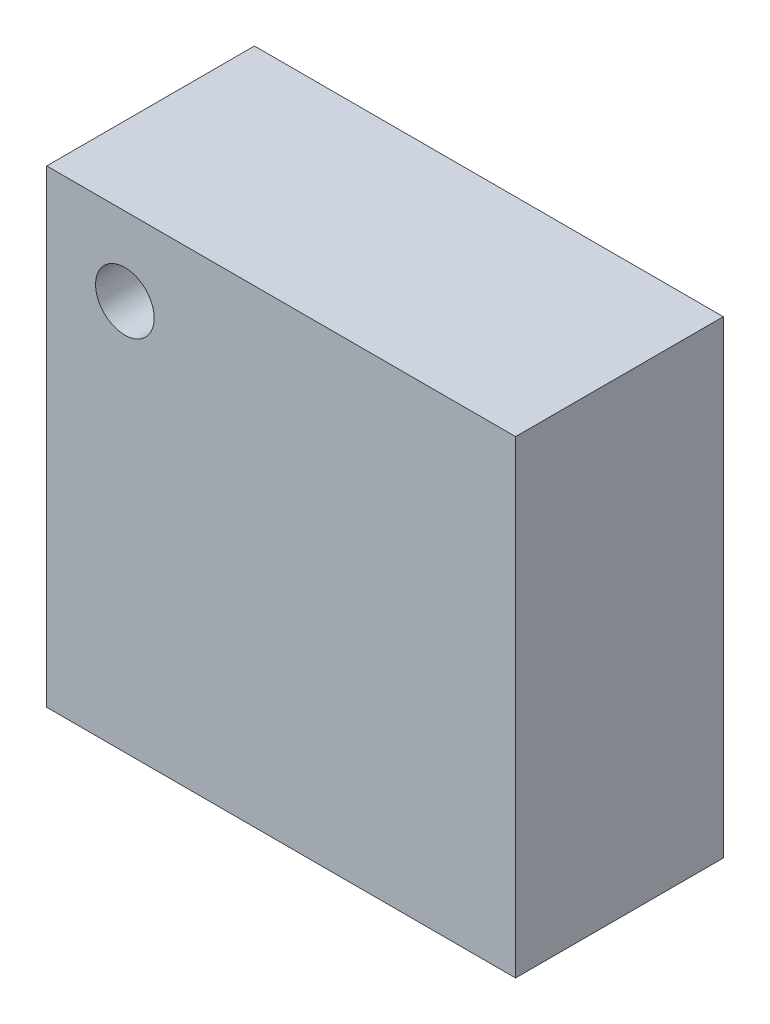
ISO-10303-21;
HEADER;
FILE_DESCRIPTION(('STEP AP214'),'2;1');
FILE_NAME('part.step','',(''),(''),'','','');
FILE_SCHEMA(('AUTOMOTIVE_DESIGN { 1 0 10303 214 1 1 1 1 }'));
ENDSEC;
DATA;
#1=APPLICATION_CONTEXT('core data for automotive mechanical design processes');
#2=APPLICATION_PROTOCOL_DEFINITION('international standard','automotive_design',2000,#1);
#3=PRODUCT_CONTEXT('',#1,'mechanical');
#4=PRODUCT('Part','Part','',(#3));
#5=PRODUCT_RELATED_PRODUCT_CATEGORY('part','',(#4));
#6=PRODUCT_DEFINITION_FORMATION('','',#4);
#7=PRODUCT_DEFINITION_CONTEXT('part definition',#1,'design');
#8=PRODUCT_DEFINITION('design','',#6,#7);
#9=PRODUCT_DEFINITION_SHAPE('','',#8);
#10=(LENGTH_UNIT() NAMED_UNIT(*) SI_UNIT(.MILLI.,.METRE.));
#11=(NAMED_UNIT(*) PLANE_ANGLE_UNIT() SI_UNIT($,.RADIAN.));
#12=(NAMED_UNIT(*) SI_UNIT($,.STERADIAN.) SOLID_ANGLE_UNIT());
#13=UNCERTAINTY_MEASURE_WITH_UNIT(LENGTH_MEASURE(1.E-05),#10,'distance_accuracy_value','');
#14=(GEOMETRIC_REPRESENTATION_CONTEXT(3) GLOBAL_UNCERTAINTY_ASSIGNED_CONTEXT((#13)) GLOBAL_UNIT_ASSIGNED_CONTEXT((#10,
#11,#12)) REPRESENTATION_CONTEXT('',''));
#15=CARTESIAN_POINT('',(0.,0.,0.));
#16=DIRECTION('',(0.,0.,1.));
#17=DIRECTION('',(1.,0.,0.));
#18=AXIS2_PLACEMENT_3D('',#15,#16,#17);
#19=CARTESIAN_POINT('',(0.131666666667,0.658333333333,0.45));
#20=DIRECTION('',(0.,0.,1.));
#21=DIRECTION('',(1.,0.,0.));
#22=AXIS2_PLACEMENT_3D('',#19,#20,#21);
#23=PLANE('',#22);
#24=CARTESIAN_POINT('',(0.131666666667,0.658333333333,0.45));
#25=DIRECTION('',(0.,0.,1.));
#26=DIRECTION('',(1.,0.,0.));
#27=AXIS2_PLACEMENT_3D('',#24,#25,#26);
#28=CIRCLE('',#27,0.049375);
#29=CARTESIAN_POINT('',(0.082291666667,0.658333333333,0.45));
#30=VERTEX_POINT('',#29);
#31=EDGE_CURVE('E26',#30,#30,#28,.T.);
#32=ORIENTED_EDGE('',*,*,#31,.T.);
#33=EDGE_LOOP('',(#32));
#34=FACE_BOUND('',#33,.T.);
#35=ADVANCED_FACE('F16',(#34),#23,.T.);
#36=CARTESIAN_POINT('',(0.131666666667,0.658333333333,0.45));
#37=DIRECTION('',(0.,0.,1.));
#38=DIRECTION('',(1.,0.,0.));
#39=AXIS2_PLACEMENT_3D('',#36,#37,#38);
#40=CYLINDRICAL_SURFACE('',#39,0.049375);
#41=ORIENTED_EDGE('',*,*,#31,.F.);
#42=DIRECTION('',(0.,0.,1.));
#43=VECTOR('',#42,1.);
#44=CARTESIAN_POINT('',(0.082291666667,0.658333333333,0.45));
#45=LINE('',#44,#43);
#46=CARTESIAN_POINT('',(0.082291666667,0.658333333333,0.55));
#47=VERTEX_POINT('',#46);
#48=EDGE_CURVE('E11',#30,#47,#45,.T.);
#49=ORIENTED_EDGE('',*,*,#48,.T.);
#50=CARTESIAN_POINT('',(0.131666666667,0.658333333333,0.55));
#51=DIRECTION('',(0.,0.,1.));
#52=DIRECTION('',(1.,0.,0.));
#53=AXIS2_PLACEMENT_3D('',#50,#51,#52);
#54=CIRCLE('',#53,0.049375);
#55=EDGE_CURVE('E128',#47,#47,#54,.T.);
#56=ORIENTED_EDGE('',*,*,#55,.T.);
#57=ORIENTED_EDGE('',*,*,#48,.F.);
#58=EDGE_LOOP('',(#41,#49,#56,#57));
#59=FACE_BOUND('',#58,.T.);
#60=ADVANCED_FACE('F147',(#59),#40,.F.);
#61=CARTESIAN_POINT('',(0.79,0.,0.2));
#62=DIRECTION('',(1.,0.,0.));
#63=DIRECTION('',(0.,1.,0.));
#64=AXIS2_PLACEMENT_3D('',#61,#62,#63);
#65=PLANE('',#64);
#66=DIRECTION('',(0.,0.,1.));
#67=VECTOR('',#66,1.);
#68=CARTESIAN_POINT('',(0.79,0.,0.2));
#69=LINE('',#68,#67);
#70=CARTESIAN_POINT('',(0.79,0.,0.2));
#71=VERTEX_POINT('',#70);
#72=CARTESIAN_POINT('',(0.79,0.,0.55));
#73=VERTEX_POINT('',#72);
#74=EDGE_CURVE('E67',#71,#73,#69,.T.);
#75=ORIENTED_EDGE('',*,*,#74,.F.);
#76=DIRECTION('',(0.,1.,0.));
#77=VECTOR('',#76,1.);
#78=CARTESIAN_POINT('',(0.79,0.,0.2));
#79=LINE('',#78,#77);
#80=CARTESIAN_POINT('',(0.79,0.79,0.2));
#81=VERTEX_POINT('',#80);
#82=EDGE_CURVE('E107',#71,#81,#79,.T.);
#83=ORIENTED_EDGE('',*,*,#82,.T.);
#84=DIRECTION('',(0.,0.,1.));
#85=VECTOR('',#84,1.);
#86=CARTESIAN_POINT('',(0.79,0.79,0.2));
#87=LINE('',#86,#85);
#88=CARTESIAN_POINT('',(0.79,0.79,0.55));
#89=VERTEX_POINT('',#88);
#90=EDGE_CURVE('E70',#81,#89,#87,.T.);
#91=ORIENTED_EDGE('',*,*,#90,.T.);
#92=DIRECTION('',(0.,1.,0.));
#93=VECTOR('',#92,1.);
#94=CARTESIAN_POINT('',(0.79,0.,0.55));
#95=LINE('',#94,#93);
#96=EDGE_CURVE('E63',#73,#89,#95,.T.);
#97=ORIENTED_EDGE('',*,*,#96,.F.);
#98=EDGE_LOOP('',(#75,#83,#91,#97));
#99=FACE_BOUND('',#98,.T.);
#100=ADVANCED_FACE('F65',(#99),#65,.T.);
#101=CARTESIAN_POINT('',(0.,0.,0.2));
#102=DIRECTION('',(0.,0.,1.));
#103=DIRECTION('',(1.,0.,0.));
#104=AXIS2_PLACEMENT_3D('',#101,#102,#103);
#105=PLANE('',#104);
#106=DIRECTION('',(0.,1.,0.));
#107=VECTOR('',#106,1.);
#108=CARTESIAN_POINT('',(0.,0.,0.2));
#109=LINE('',#108,#107);
#110=CARTESIAN_POINT('',(0.,0.,0.2));
#111=VERTEX_POINT('',#110);
#112=CARTESIAN_POINT('',(0.,0.79,0.2));
#113=VERTEX_POINT('',#112);
#114=EDGE_CURVE('E96',#111,#113,#109,.T.);
#115=ORIENTED_EDGE('',*,*,#114,.T.);
#116=DIRECTION('',(1.,0.,0.));
#117=VECTOR('',#116,1.);
#118=CARTESIAN_POINT('',(0.,0.79,0.2));
#119=LINE('',#118,#117);
#120=EDGE_CURVE('E99',#113,#81,#119,.T.);
#121=ORIENTED_EDGE('',*,*,#120,.T.);
#122=ORIENTED_EDGE('',*,*,#82,.F.);
#123=DIRECTION('',(1.,0.,0.));
#124=VECTOR('',#123,1.);
#125=CARTESIAN_POINT('',(0.,0.,0.2));
#126=LINE('',#125,#124);
#127=EDGE_CURVE('E89',#111,#71,#126,.T.);
#128=ORIENTED_EDGE('',*,*,#127,.F.);
#129=EDGE_LOOP('',(#115,#121,#122,#128));
#130=FACE_BOUND('',#129,.T.);
#131=ADVANCED_FACE('F167',(#130),#105,.F.);
#132=CARTESIAN_POINT('',(0.,0.79,0.2));
#133=DIRECTION('',(0.,1.,0.));
#134=DIRECTION('',(1.,0.,0.));
#135=AXIS2_PLACEMENT_3D('',#132,#133,#134);
#136=PLANE('',#135);
#137=ORIENTED_EDGE('',*,*,#120,.F.);
#138=DIRECTION('',(0.,0.,1.));
#139=VECTOR('',#138,1.);
#140=CARTESIAN_POINT('',(0.,0.79,0.2));
#141=LINE('',#140,#139);
#142=CARTESIAN_POINT('',(0.,0.79,0.55));
#143=VERTEX_POINT('',#142);
#144=EDGE_CURVE('E105',#113,#143,#141,.T.);
#145=ORIENTED_EDGE('',*,*,#144,.T.);
#146=DIRECTION('',(1.,0.,0.));
#147=VECTOR('',#146,1.);
#148=CARTESIAN_POINT('',(0.,0.79,0.55));
#149=LINE('',#148,#147);
#150=EDGE_CURVE('E75',#143,#89,#149,.T.);
#151=ORIENTED_EDGE('',*,*,#150,.T.);
#152=ORIENTED_EDGE('',*,*,#90,.F.);
#153=EDGE_LOOP('',(#137,#145,#151,#152));
#154=FACE_BOUND('',#153,.T.);
#155=ADVANCED_FACE('F18',(#154),#136,.T.);
#156=CARTESIAN_POINT('',(0.,0.,0.55));
#157=DIRECTION('',(0.,0.,1.));
#158=DIRECTION('',(1.,0.,0.));
#159=AXIS2_PLACEMENT_3D('',#156,#157,#158);
#160=PLANE('',#159);
#161=ORIENTED_EDGE('',*,*,#55,.F.);
#162=EDGE_LOOP('',(#161));
#163=FACE_BOUND('',#162,.T.);
#164=DIRECTION('',(0.,1.,0.));
#165=VECTOR('',#164,1.);
#166=CARTESIAN_POINT('',(0.,0.,0.55));
#167=LINE('',#166,#165);
#168=CARTESIAN_POINT('',(0.,0.,0.55));
#169=VERTEX_POINT('',#168);
#170=EDGE_CURVE('E82',#169,#143,#167,.T.);
#171=ORIENTED_EDGE('',*,*,#170,.F.);
#172=DIRECTION('',(1.,0.,0.));
#173=VECTOR('',#172,1.);
#174=CARTESIAN_POINT('',(0.,0.,0.55));
#175=LINE('',#174,#173);
#176=EDGE_CURVE('E76',#169,#73,#175,.T.);
#177=ORIENTED_EDGE('',*,*,#176,.T.);
#178=ORIENTED_EDGE('',*,*,#96,.T.);
#179=ORIENTED_EDGE('',*,*,#150,.F.);
#180=EDGE_LOOP('',(#171,#177,#178,#179));
#181=FACE_BOUND('',#180,.T.);
#182=ADVANCED_FACE('F80',(#163,#181),#160,.T.);
#183=CARTESIAN_POINT('',(0.,0.,0.2));
#184=DIRECTION('',(0.,1.,0.));
#185=DIRECTION('',(1.,0.,0.));
#186=AXIS2_PLACEMENT_3D('',#183,#184,#185);
#187=PLANE('',#186);
#188=ORIENTED_EDGE('',*,*,#127,.T.);
#189=ORIENTED_EDGE('',*,*,#74,.T.);
#190=ORIENTED_EDGE('',*,*,#176,.F.);
#191=DIRECTION('',(0.,0.,1.));
#192=VECTOR('',#191,1.);
#193=CARTESIAN_POINT('',(0.,0.,0.2));
#194=LINE('',#193,#192);
#195=EDGE_CURVE('E111',#111,#169,#194,.T.);
#196=ORIENTED_EDGE('',*,*,#195,.F.);
#197=EDGE_LOOP('',(#188,#189,#190,#196));
#198=FACE_BOUND('',#197,.T.);
#199=ADVANCED_FACE('F88',(#198),#187,.F.);
#200=CARTESIAN_POINT('',(0.,0.,0.2));
#201=DIRECTION('',(1.,0.,0.));
#202=DIRECTION('',(0.,1.,0.));
#203=AXIS2_PLACEMENT_3D('',#200,#201,#202);
#204=PLANE('',#203);
#205=ORIENTED_EDGE('',*,*,#195,.T.);
#206=ORIENTED_EDGE('',*,*,#170,.T.);
#207=ORIENTED_EDGE('',*,*,#144,.F.);
#208=ORIENTED_EDGE('',*,*,#114,.F.);
#209=EDGE_LOOP('',(#205,#206,#207,#208));
#210=FACE_BOUND('',#209,.T.);
#211=ADVANCED_FACE('F159',(#210),#204,.F.);
#212=CLOSED_SHELL('',(#35,#60,#100,#131,#155,#182,#199,#211));
#213=MANIFOLD_SOLID_BREP('B1',#212);
#214=ADVANCED_BREP_SHAPE_REPRESENTATION('',(#18,#213),#14);
#215=SHAPE_DEFINITION_REPRESENTATION(#9,#214);
ENDSEC;
END-ISO-10303-21;
